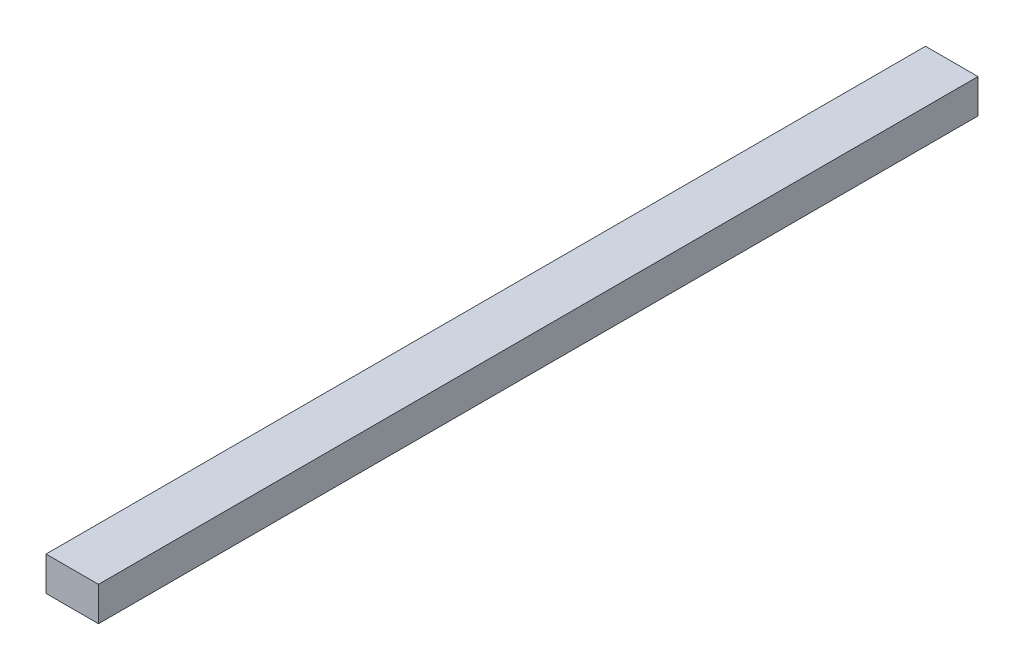
ISO-10303-21;
HEADER;
FILE_DESCRIPTION(('STEP AP214'),'2;1');
FILE_NAME('part.step','',(''),(''),'','','');
FILE_SCHEMA(('AUTOMOTIVE_DESIGN { 1 0 10303 214 1 1 1 1 }'));
ENDSEC;
DATA;
#1=APPLICATION_CONTEXT('core data for automotive mechanical design processes');
#2=APPLICATION_PROTOCOL_DEFINITION('international standard','automotive_design',2000,#1);
#3=PRODUCT_CONTEXT('',#1,'mechanical');
#4=PRODUCT('Part','Part','',(#3));
#5=PRODUCT_RELATED_PRODUCT_CATEGORY('part','',(#4));
#6=PRODUCT_DEFINITION_FORMATION('','',#4);
#7=PRODUCT_DEFINITION_CONTEXT('part definition',#1,'design');
#8=PRODUCT_DEFINITION('design','',#6,#7);
#9=PRODUCT_DEFINITION_SHAPE('','',#8);
#10=(LENGTH_UNIT() NAMED_UNIT(*) SI_UNIT(.MILLI.,.METRE.));
#11=(NAMED_UNIT(*) PLANE_ANGLE_UNIT() SI_UNIT($,.RADIAN.));
#12=(NAMED_UNIT(*) SI_UNIT($,.STERADIAN.) SOLID_ANGLE_UNIT());
#13=UNCERTAINTY_MEASURE_WITH_UNIT(LENGTH_MEASURE(1.E-05),#10,'distance_accuracy_value','');
#14=(GEOMETRIC_REPRESENTATION_CONTEXT(3) GLOBAL_UNCERTAINTY_ASSIGNED_CONTEXT((#13)) GLOBAL_UNIT_ASSIGNED_CONTEXT((#10,
#11,#12)) REPRESENTATION_CONTEXT('',''));
#15=CARTESIAN_POINT('',(0.,0.,0.));
#16=DIRECTION('',(0.,0.,1.));
#17=DIRECTION('',(1.,0.,0.));
#18=AXIS2_PLACEMENT_3D('',#15,#16,#17);
#19=CARTESIAN_POINT('',(0.,5.96900000000002,0.));
#20=DIRECTION('',(0.,1.,0.));
#21=DIRECTION('',(0.,0.,1.));
#22=AXIS2_PLACEMENT_3D('',#19,#20,#21);
#23=PLANE('',#22);
#24=DIRECTION('',(1.,0.,0.));
#25=VECTOR('',#24,1.);
#26=CARTESIAN_POINT('',(0.,5.96900000000002,24.511));
#27=LINE('',#26,#25);
#28=CARTESIAN_POINT('',(-18.161,5.96900000000002,24.511));
#29=VERTEX_POINT('',#28);
#30=CARTESIAN_POINT('',(18.161,5.96900000000002,24.511));
#31=VERTEX_POINT('',#30);
#32=EDGE_CURVE('E58',#29,#31,#27,.T.);
#33=ORIENTED_EDGE('',*,*,#32,.F.);
#34=DIRECTION('',(0.,0.,1.));
#35=VECTOR('',#34,1.);
#36=CARTESIAN_POINT('',(-18.161,5.96900000000002,0.));
#37=LINE('',#36,#35);
#38=CARTESIAN_POINT('',(-18.161,5.96900000000002,-584.2));
#39=VERTEX_POINT('',#38);
#40=EDGE_CURVE('E98',#39,#29,#37,.T.);
#41=ORIENTED_EDGE('',*,*,#40,.F.);
#42=DIRECTION('',(1.,0.,0.));
#43=VECTOR('',#42,1.);
#44=CARTESIAN_POINT('',(0.,5.96900000000002,-584.2));
#45=LINE('',#44,#43);
#46=CARTESIAN_POINT('',(18.161,5.96900000000002,-584.2));
#47=VERTEX_POINT('',#46);
#48=EDGE_CURVE('E110',#39,#47,#45,.T.);
#49=ORIENTED_EDGE('',*,*,#48,.T.);
#50=DIRECTION('',(0.,0.,1.));
#51=VECTOR('',#50,1.);
#52=CARTESIAN_POINT('',(18.161,5.96900000000002,0.));
#53=LINE('',#52,#51);
#54=EDGE_CURVE('E107',#47,#31,#53,.T.);
#55=ORIENTED_EDGE('',*,*,#54,.T.);
#56=EDGE_LOOP('',(#33,#41,#49,#55));
#57=FACE_BOUND('',#56,.T.);
#58=ADVANCED_FACE('F43',(#57),#23,.F.);
#59=CARTESIAN_POINT('',(0.,29.591,0.));
#60=DIRECTION('',(0.,1.,0.));
#61=DIRECTION('',(0.,0.,1.));
#62=AXIS2_PLACEMENT_3D('',#59,#60,#61);
#63=PLANE('',#62);
#64=DIRECTION('',(0.,0.,1.));
#65=VECTOR('',#64,1.);
#66=CARTESIAN_POINT('',(-18.161,29.591,0.));
#67=LINE('',#66,#65);
#68=CARTESIAN_POINT('',(-18.161,29.591,-584.2));
#69=VERTEX_POINT('',#68);
#70=CARTESIAN_POINT('',(-18.161,29.591,24.511));
#71=VERTEX_POINT('',#70);
#72=EDGE_CURVE('E95',#69,#71,#67,.T.);
#73=ORIENTED_EDGE('',*,*,#72,.T.);
#74=DIRECTION('',(1.,0.,0.));
#75=VECTOR('',#74,1.);
#76=CARTESIAN_POINT('',(0.,29.591,24.511));
#77=LINE('',#76,#75);
#78=CARTESIAN_POINT('',(18.161,29.591,24.511));
#79=VERTEX_POINT('',#78);
#80=EDGE_CURVE('E83',#71,#79,#77,.T.);
#81=ORIENTED_EDGE('',*,*,#80,.T.);
#82=DIRECTION('',(0.,0.,1.));
#83=VECTOR('',#82,1.);
#84=CARTESIAN_POINT('',(18.161,29.591,0.));
#85=LINE('',#84,#83);
#86=CARTESIAN_POINT('',(18.161,29.591,-584.2));
#87=VERTEX_POINT('',#86);
#88=EDGE_CURVE('E93',#87,#79,#85,.T.);
#89=ORIENTED_EDGE('',*,*,#88,.F.);
#90=DIRECTION('',(1.,0.,0.));
#91=VECTOR('',#90,1.);
#92=CARTESIAN_POINT('',(0.,29.591,-584.2));
#93=LINE('',#92,#91);
#94=EDGE_CURVE('E65',#69,#87,#93,.T.);
#95=ORIENTED_EDGE('',*,*,#94,.F.);
#96=EDGE_LOOP('',(#73,#81,#89,#95));
#97=FACE_BOUND('',#96,.T.);
#98=ADVANCED_FACE('F92',(#97),#63,.T.);
#99=CARTESIAN_POINT('',(-18.161,0.,0.));
#100=DIRECTION('',(1.,0.,0.));
#101=DIRECTION('',(0.,0.,-1.));
#102=AXIS2_PLACEMENT_3D('',#99,#100,#101);
#103=PLANE('',#102);
#104=DIRECTION('',(0.,-1.,0.));
#105=VECTOR('',#104,1.);
#106=CARTESIAN_POINT('',(-18.161,0.,24.511));
#107=LINE('',#106,#105);
#108=EDGE_CURVE('E99',#71,#29,#107,.T.);
#109=ORIENTED_EDGE('',*,*,#108,.F.);
#110=ORIENTED_EDGE('',*,*,#72,.F.);
#111=DIRECTION('',(0.,-1.,0.));
#112=VECTOR('',#111,1.);
#113=CARTESIAN_POINT('',(-18.161,0.,-584.2));
#114=LINE('',#113,#112);
#115=EDGE_CURVE('E108',#69,#39,#114,.T.);
#116=ORIENTED_EDGE('',*,*,#115,.T.);
#117=ORIENTED_EDGE('',*,*,#40,.T.);
#118=EDGE_LOOP('',(#109,#110,#116,#117));
#119=FACE_BOUND('',#118,.T.);
#120=ADVANCED_FACE('F117',(#119),#103,.F.);
#121=CARTESIAN_POINT('',(18.161,0.,0.));
#122=DIRECTION('',(1.,0.,0.));
#123=DIRECTION('',(0.,0.,-1.));
#124=AXIS2_PLACEMENT_3D('',#121,#122,#123);
#125=PLANE('',#124);
#126=ORIENTED_EDGE('',*,*,#88,.T.);
#127=DIRECTION('',(0.,-1.,0.));
#128=VECTOR('',#127,1.);
#129=CARTESIAN_POINT('',(18.161,0.,24.511));
#130=LINE('',#129,#128);
#131=EDGE_CURVE('E11',#79,#31,#130,.T.);
#132=ORIENTED_EDGE('',*,*,#131,.T.);
#133=ORIENTED_EDGE('',*,*,#54,.F.);
#134=DIRECTION('',(0.,-1.,0.));
#135=VECTOR('',#134,1.);
#136=CARTESIAN_POINT('',(18.161,0.,-584.2));
#137=LINE('',#136,#135);
#138=EDGE_CURVE('E51',#87,#47,#137,.T.);
#139=ORIENTED_EDGE('',*,*,#138,.F.);
#140=EDGE_LOOP('',(#126,#132,#133,#139));
#141=FACE_BOUND('',#140,.T.);
#142=ADVANCED_FACE('F97',(#141),#125,.T.);
#143=CARTESIAN_POINT('',(0.,0.,-584.2));
#144=DIRECTION('',(0.,0.,1.));
#145=DIRECTION('',(1.,0.,0.));
#146=AXIS2_PLACEMENT_3D('',#143,#144,#145);
#147=PLANE('',#146);
#148=ORIENTED_EDGE('',*,*,#138,.T.);
#149=ORIENTED_EDGE('',*,*,#48,.F.);
#150=ORIENTED_EDGE('',*,*,#115,.F.);
#151=ORIENTED_EDGE('',*,*,#94,.T.);
#152=EDGE_LOOP('',(#148,#149,#150,#151));
#153=FACE_BOUND('',#152,.T.);
#154=ADVANCED_FACE('F45',(#153),#147,.F.);
#155=CARTESIAN_POINT('',(0.,0.,24.511));
#156=DIRECTION('',(0.,0.,1.));
#157=DIRECTION('',(1.,0.,0.));
#158=AXIS2_PLACEMENT_3D('',#155,#156,#157);
#159=PLANE('',#158);
#160=ORIENTED_EDGE('',*,*,#108,.T.);
#161=ORIENTED_EDGE('',*,*,#32,.T.);
#162=ORIENTED_EDGE('',*,*,#131,.F.);
#163=ORIENTED_EDGE('',*,*,#80,.F.);
#164=EDGE_LOOP('',(#160,#161,#162,#163));
#165=FACE_BOUND('',#164,.T.);
#166=ADVANCED_FACE('F82',(#165),#159,.T.);
#167=CLOSED_SHELL('',(#58,#98,#120,#142,#154,#166));
#168=MANIFOLD_SOLID_BREP('B2',#167);
#169=ADVANCED_BREP_SHAPE_REPRESENTATION('',(#18,#168),#14);
#170=SHAPE_DEFINITION_REPRESENTATION(#9,#169);
ENDSEC;
END-ISO-10303-21;
